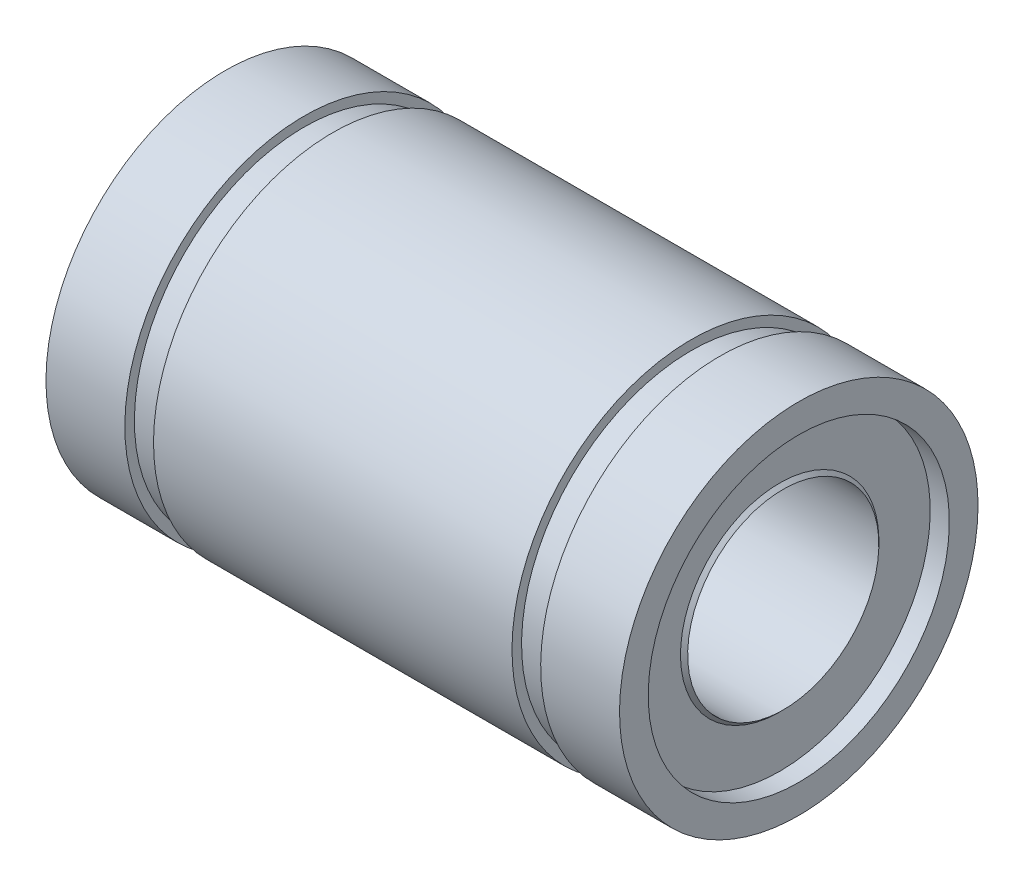
ISO-10303-21;
HEADER;
FILE_DESCRIPTION(('STEP AP214'),'2;1');
FILE_NAME('part.step','',(''),(''),'','','');
FILE_SCHEMA(('AUTOMOTIVE_DESIGN { 1 0 10303 214 1 1 1 1 }'));
ENDSEC;
DATA;
#1=APPLICATION_CONTEXT('core data for automotive mechanical design processes');
#2=APPLICATION_PROTOCOL_DEFINITION('international standard','automotive_design',2000,#1);
#3=PRODUCT_CONTEXT('',#1,'mechanical');
#4=PRODUCT('Part','Part','',(#3));
#5=PRODUCT_RELATED_PRODUCT_CATEGORY('part','',(#4));
#6=PRODUCT_DEFINITION_FORMATION('','',#4);
#7=PRODUCT_DEFINITION_CONTEXT('part definition',#1,'design');
#8=PRODUCT_DEFINITION('design','',#6,#7);
#9=PRODUCT_DEFINITION_SHAPE('','',#8);
#10=(LENGTH_UNIT() NAMED_UNIT(*) SI_UNIT(.MILLI.,.METRE.));
#11=(NAMED_UNIT(*) PLANE_ANGLE_UNIT() SI_UNIT($,.RADIAN.));
#12=(NAMED_UNIT(*) SI_UNIT($,.STERADIAN.) SOLID_ANGLE_UNIT());
#13=UNCERTAINTY_MEASURE_WITH_UNIT(LENGTH_MEASURE(1.E-05),#10,'distance_accuracy_value','');
#14=(GEOMETRIC_REPRESENTATION_CONTEXT(3) GLOBAL_UNCERTAINTY_ASSIGNED_CONTEXT((#13)) GLOBAL_UNIT_ASSIGNED_CONTEXT((#10,
#11,#12)) REPRESENTATION_CONTEXT('',''));
#15=CARTESIAN_POINT('',(0.,0.,0.));
#16=DIRECTION('',(0.,0.,1.));
#17=DIRECTION('',(1.,0.,0.));
#18=AXIS2_PLACEMENT_3D('',#15,#16,#17);
#19=CARTESIAN_POINT('',(-16.830555472771,-10.245239863841,5.674899117618));
#20=DIRECTION('',(1.,0.,0.));
#21=DIRECTION('',(0.,-0.982567445911182,-0.185906466362998));
#22=AXIS2_PLACEMENT_3D('',#19,#20,#21);
#23=CONICAL_SURFACE('',#22,4.075,0.785398163397448);
#24=CARTESIAN_POINT('',(-16.755555472771,-10.245239863841,5.674899117618));
#25=DIRECTION('',(1.,0.,0.));
#26=DIRECTION('',(0.,-0.185906466362998,0.982567445911182));
#27=AXIS2_PLACEMENT_3D('',#24,#25,#26);
#28=CIRCLE('',#27,4.15);
#29=CARTESIAN_POINT('',(-16.755555472771,-14.3228947643724,4.90338728221156));
#30=VERTEX_POINT('',#29);
#31=CARTESIAN_POINT('',(-16.755555472771,-6.16758496330959,6.44641095302444));
#32=VERTEX_POINT('',#31);
#33=EDGE_CURVE('E41',#30,#32,#28,.T.);
#34=ORIENTED_EDGE('',*,*,#33,.F.);
#35=CARTESIAN_POINT('',(-16.755555472771,-10.245239863841,5.674899117618));
#36=DIRECTION('',(1.,0.,0.));
#37=DIRECTION('',(0.,-0.185906466362998,0.982567445911182));
#38=AXIS2_PLACEMENT_3D('',#35,#36,#37);
#39=CIRCLE('',#38,4.15);
#40=EDGE_CURVE('E207',#32,#30,#39,.T.);
#41=ORIENTED_EDGE('',*,*,#40,.F.);
#42=DIRECTION('',(-0.707106781186547,-0.694780103976944,-0.131455723031705));
#43=VECTOR('',#42,1.);
#44=CARTESIAN_POINT('',(-16.830555472771,-6.24127752175293,6.43246796804722));
#45=LINE('',#44,#43);
#46=CARTESIAN_POINT('',(-16.905555472771,-6.31497008019627,6.41852498306999));
#47=VERTEX_POINT('',#46);
#48=EDGE_CURVE('E11',#32,#47,#45,.T.);
#49=ORIENTED_EDGE('',*,*,#48,.T.);
#50=CARTESIAN_POINT('',(-16.905555472771,-10.245239863841,5.674899117618));
#51=DIRECTION('',(1.,0.,0.));
#52=DIRECTION('',(0.,-0.185906466362998,0.982567445911182));
#53=AXIS2_PLACEMENT_3D('',#50,#51,#52);
#54=CIRCLE('',#53,4.);
#55=CARTESIAN_POINT('',(-16.905555472771,-14.1755096474857,4.93127325216601));
#56=VERTEX_POINT('',#55);
#57=EDGE_CURVE('E27',#47,#56,#54,.T.);
#58=ORIENTED_EDGE('',*,*,#57,.T.);
#59=CARTESIAN_POINT('',(-16.905555472771,-10.245239863841,5.674899117618));
#60=DIRECTION('',(1.,0.,0.));
#61=DIRECTION('',(0.,-0.185906466362998,0.982567445911182));
#62=AXIS2_PLACEMENT_3D('',#59,#60,#61);
#63=CIRCLE('',#62,4.);
#64=EDGE_CURVE('E206',#56,#47,#63,.T.);
#65=ORIENTED_EDGE('',*,*,#64,.T.);
#66=ORIENTED_EDGE('',*,*,#48,.F.);
#67=EDGE_LOOP('',(#34,#41,#49,#58,#65,#66));
#68=FACE_BOUND('',#67,.T.);
#69=ADVANCED_FACE('F16',(#68),#23,.T.);
#70=CARTESIAN_POINT('',(-16.755555472771,-16.4354147730814,4.50368837953111));
#71=DIRECTION('',(-1.,0.,0.));
#72=DIRECTION('',(0.,0.185906466362998,-0.982567445911182));
#73=AXIS2_PLACEMENT_3D('',#70,#71,#72);
#74=PLANE('',#73);
#75=CARTESIAN_POINT('',(-16.755555472771,-10.245239863841,5.674899117618));
#76=DIRECTION('',(1.,0.,0.));
#77=DIRECTION('',(0.,-0.185906466362998,0.982567445911182));
#78=AXIS2_PLACEMENT_3D('',#75,#76,#77);
#79=CIRCLE('',#78,6.3);
#80=CARTESIAN_POINT('',(-16.755555472771,-16.4354147730814,4.50368837953111));
#81=VERTEX_POINT('',#80);
#82=CARTESIAN_POINT('',(-16.755555472771,-4.05506495460056,6.84610985570489));
#83=VERTEX_POINT('',#82);
#84=EDGE_CURVE('E289',#81,#83,#79,.T.);
#85=ORIENTED_EDGE('',*,*,#84,.F.);
#86=CARTESIAN_POINT('',(-16.755555472771,-10.245239863841,5.674899117618));
#87=DIRECTION('',(1.,0.,0.));
#88=DIRECTION('',(0.,-0.185906466362998,0.982567445911182));
#89=AXIS2_PLACEMENT_3D('',#86,#87,#88);
#90=CIRCLE('',#89,6.3);
#91=EDGE_CURVE('E239',#83,#81,#90,.T.);
#92=ORIENTED_EDGE('',*,*,#91,.F.);
#93=EDGE_LOOP('',(#85,#92));
#94=FACE_BOUND('',#93,.T.);
#95=ORIENTED_EDGE('',*,*,#33,.T.);
#96=ORIENTED_EDGE('',*,*,#40,.T.);
#97=EDGE_LOOP('',(#95,#96));
#98=FACE_BOUND('',#97,.T.);
#99=ADVANCED_FACE('F370',(#94,#98),#74,.T.);
#100=CARTESIAN_POINT('',(-17.155555472771,-10.245239863841,5.674899117618));
#101=DIRECTION('',(1.,0.,0.));
#102=DIRECTION('',(0.,-0.982567445911182,-0.185906466362998));
#103=AXIS2_PLACEMENT_3D('',#100,#101,#102);
#104=CYLINDRICAL_SURFACE('',#103,6.3);
#105=ORIENTED_EDGE('',*,*,#84,.T.);
#106=DIRECTION('',(-1.,0.,0.));
#107=VECTOR('',#106,1.);
#108=CARTESIAN_POINT('',(-17.155555472771,-4.05506495460056,6.84610985570489));
#109=LINE('',#108,#107);
#110=CARTESIAN_POINT('',(-17.555555472771,-4.05506495460056,6.84610985570489));
#111=VERTEX_POINT('',#110);
#112=EDGE_CURVE('E243',#83,#111,#109,.T.);
#113=ORIENTED_EDGE('',*,*,#112,.T.);
#114=CARTESIAN_POINT('',(-17.555555472771,-10.245239863841,5.674899117618));
#115=DIRECTION('',(1.,0.,0.));
#116=DIRECTION('',(0.,-0.185906466362998,0.982567445911182));
#117=AXIS2_PLACEMENT_3D('',#114,#115,#116);
#118=CIRCLE('',#117,6.3);
#119=CARTESIAN_POINT('',(-17.555555472771,-16.4354147730814,4.50368837953111));
#120=VERTEX_POINT('',#119);
#121=EDGE_CURVE('E199',#120,#111,#118,.T.);
#122=ORIENTED_EDGE('',*,*,#121,.F.);
#123=CARTESIAN_POINT('',(-17.555555472771,-10.245239863841,5.674899117618));
#124=DIRECTION('',(1.,0.,0.));
#125=DIRECTION('',(0.,-0.185906466362998,0.982567445911182));
#126=AXIS2_PLACEMENT_3D('',#123,#124,#125);
#127=CIRCLE('',#126,6.3);
#128=EDGE_CURVE('E192',#111,#120,#127,.T.);
#129=ORIENTED_EDGE('',*,*,#128,.F.);
#130=ORIENTED_EDGE('',*,*,#112,.F.);
#131=ORIENTED_EDGE('',*,*,#91,.T.);
#132=EDGE_LOOP('',(#105,#113,#122,#129,#130,#131));
#133=FACE_BOUND('',#132,.T.);
#134=ADVANCED_FACE('F375',(#133),#104,.F.);
#135=CARTESIAN_POINT('',(-17.555555472771,-17.6144957081749,4.28060061989552));
#136=DIRECTION('',(-1.,0.,0.));
#137=DIRECTION('',(0.,0.185906466362998,-0.982567445911182));
#138=AXIS2_PLACEMENT_3D('',#135,#136,#137);
#139=PLANE('',#138);
#140=CARTESIAN_POINT('',(-17.555555472771,-10.245239863841,5.674899117618));
#141=DIRECTION('',(1.,0.,0.));
#142=DIRECTION('',(0.,-0.185906466362998,0.982567445911182));
#143=AXIS2_PLACEMENT_3D('',#140,#141,#142);
#144=CIRCLE('',#143,7.5);
#145=CARTESIAN_POINT('',(-17.555555472771,-17.6144957081749,4.28060061989552));
#146=VERTEX_POINT('',#145);
#147=CARTESIAN_POINT('',(-17.555555472771,-2.87598401950713,7.06919761534049));
#148=VERTEX_POINT('',#147);
#149=EDGE_CURVE('E20',#146,#148,#144,.T.);
#150=ORIENTED_EDGE('',*,*,#149,.F.);
#151=CARTESIAN_POINT('',(-17.555555472771,-10.245239863841,5.674899117618));
#152=DIRECTION('',(1.,0.,0.));
#153=DIRECTION('',(0.,-0.185906466362998,0.982567445911182));
#154=AXIS2_PLACEMENT_3D('',#151,#152,#153);
#155=CIRCLE('',#154,7.5);
#156=EDGE_CURVE('E180',#148,#146,#155,.T.);
#157=ORIENTED_EDGE('',*,*,#156,.F.);
#158=EDGE_LOOP('',(#150,#157));
#159=FACE_BOUND('',#158,.T.);
#160=ORIENTED_EDGE('',*,*,#121,.T.);
#161=ORIENTED_EDGE('',*,*,#128,.T.);
#162=EDGE_LOOP('',(#160,#161));
#163=FACE_BOUND('',#162,.T.);
#164=ADVANCED_FACE('F184',(#159,#163),#139,.T.);
#165=CARTESIAN_POINT('',(-15.905555472771,-10.245239863841,5.674899117618));
#166=DIRECTION('',(1.,0.,0.));
#167=DIRECTION('',(0.,-0.982567445911182,-0.185906466362998));
#168=AXIS2_PLACEMENT_3D('',#165,#166,#167);
#169=CYLINDRICAL_SURFACE('',#168,7.5);
#170=CARTESIAN_POINT('',(-14.255555472771,-10.245239863841,5.674899117618));
#171=DIRECTION('',(1.,0.,0.));
#172=DIRECTION('',(0.,-0.185906466362998,0.982567445911182));
#173=AXIS2_PLACEMENT_3D('',#170,#171,#172);
#174=CIRCLE('',#173,7.5);
#175=CARTESIAN_POINT('',(-14.255555472771,-17.6144957081749,4.28060061989552));
#176=VERTEX_POINT('',#175);
#177=CARTESIAN_POINT('',(-14.255555472771,-2.87598401950713,7.06919761534049));
#178=VERTEX_POINT('',#177);
#179=EDGE_CURVE('E183',#176,#178,#174,.T.);
#180=ORIENTED_EDGE('',*,*,#179,.F.);
#181=CARTESIAN_POINT('',(-14.255555472771,-10.245239863841,5.674899117618));
#182=DIRECTION('',(1.,0.,0.));
#183=DIRECTION('',(0.,-0.185906466362998,0.982567445911182));
#184=AXIS2_PLACEMENT_3D('',#181,#182,#183);
#185=CIRCLE('',#184,7.5);
#186=EDGE_CURVE('E189',#178,#176,#185,.T.);
#187=ORIENTED_EDGE('',*,*,#186,.F.);
#188=DIRECTION('',(-1.,0.,0.));
#189=VECTOR('',#188,1.);
#190=CARTESIAN_POINT('',(-15.905555472771,-2.87598401950713,7.06919761534049));
#191=LINE('',#190,#189);
#192=EDGE_CURVE('E179',#178,#148,#191,.T.);
#193=ORIENTED_EDGE('',*,*,#192,.T.);
#194=ORIENTED_EDGE('',*,*,#156,.T.);
#195=ORIENTED_EDGE('',*,*,#149,.T.);
#196=ORIENTED_EDGE('',*,*,#192,.F.);
#197=EDGE_LOOP('',(#180,#187,#193,#194,#195,#196));
#198=FACE_BOUND('',#197,.T.);
#199=ADVANCED_FACE('F177',(#198),#169,.T.);
#200=CARTESIAN_POINT('',(-14.255555472771,-17.2214687298104,4.35496320644071));
#201=DIRECTION('',(1.,0.,0.));
#202=DIRECTION('',(0.,-0.982567445911182,-0.185906466362998));
#203=AXIS2_PLACEMENT_3D('',#200,#201,#202);
#204=PLANE('',#203);
#205=ORIENTED_EDGE('',*,*,#179,.T.);
#206=ORIENTED_EDGE('',*,*,#186,.T.);
#207=EDGE_LOOP('',(#205,#206));
#208=FACE_BOUND('',#207,.T.);
#209=CARTESIAN_POINT('',(-14.255555472771,-10.245239863841,5.674899117618));
#210=DIRECTION('',(1.,0.,0.));
#211=DIRECTION('',(0.,-0.185906466362998,0.982567445911182));
#212=AXIS2_PLACEMENT_3D('',#209,#210,#211);
#213=CIRCLE('',#212,7.1);
#214=CARTESIAN_POINT('',(-14.255555472771,-17.2214687298104,4.35496320644071));
#215=VERTEX_POINT('',#214);
#216=CARTESIAN_POINT('',(-14.255555472771,-3.26901099787161,6.99483502879529));
#217=VERTEX_POINT('',#216);
#218=EDGE_CURVE('E230',#215,#217,#213,.T.);
#219=ORIENTED_EDGE('',*,*,#218,.F.);
#220=CARTESIAN_POINT('',(-14.255555472771,-10.245239863841,5.674899117618));
#221=DIRECTION('',(1.,0.,0.));
#222=DIRECTION('',(0.,-0.185906466362998,0.982567445911182));
#223=AXIS2_PLACEMENT_3D('',#220,#221,#222);
#224=CIRCLE('',#223,7.1);
#225=EDGE_CURVE('E232',#217,#215,#224,.T.);
#226=ORIENTED_EDGE('',*,*,#225,.F.);
#227=EDGE_LOOP('',(#219,#226));
#228=FACE_BOUND('',#227,.T.);
#229=ADVANCED_FACE('F354',(#208,#228),#204,.T.);
#230=CARTESIAN_POINT('',(-13.655555472771,-10.245239863841,5.674899117618));
#231=DIRECTION('',(1.,0.,0.));
#232=DIRECTION('',(0.,-0.982567445911182,-0.185906466362998));
#233=AXIS2_PLACEMENT_3D('',#230,#231,#232);
#234=CYLINDRICAL_SURFACE('',#233,7.1);
#235=CARTESIAN_POINT('',(-13.055555472771,-10.245239863841,5.674899117618));
#236=DIRECTION('',(1.,0.,0.));
#237=DIRECTION('',(0.,-0.185906466362998,0.982567445911182));
#238=AXIS2_PLACEMENT_3D('',#235,#236,#237);
#239=CIRCLE('',#238,7.1);
#240=CARTESIAN_POINT('',(-13.055555472771,-17.2214687298104,4.35496320644071));
#241=VERTEX_POINT('',#240);
#242=CARTESIAN_POINT('',(-13.055555472771,-3.26901099787161,6.99483502879529));
#243=VERTEX_POINT('',#242);
#244=EDGE_CURVE('E233',#241,#243,#239,.T.);
#245=ORIENTED_EDGE('',*,*,#244,.F.);
#246=CARTESIAN_POINT('',(-13.055555472771,-10.245239863841,5.674899117618));
#247=DIRECTION('',(1.,0.,0.));
#248=DIRECTION('',(0.,-0.185906466362998,0.982567445911182));
#249=AXIS2_PLACEMENT_3D('',#246,#247,#248);
#250=CIRCLE('',#249,7.1);
#251=EDGE_CURVE('E286',#243,#241,#250,.T.);
#252=ORIENTED_EDGE('',*,*,#251,.F.);
#253=DIRECTION('',(-1.,0.,0.));
#254=VECTOR('',#253,1.);
#255=CARTESIAN_POINT('',(-13.655555472771,-3.26901099787161,6.99483502879529));
#256=LINE('',#255,#254);
#257=EDGE_CURVE('E280',#243,#217,#256,.T.);
#258=ORIENTED_EDGE('',*,*,#257,.T.);
#259=ORIENTED_EDGE('',*,*,#225,.T.);
#260=ORIENTED_EDGE('',*,*,#218,.T.);
#261=ORIENTED_EDGE('',*,*,#257,.F.);
#262=EDGE_LOOP('',(#245,#252,#258,#259,#260,#261));
#263=FACE_BOUND('',#262,.T.);
#264=ADVANCED_FACE('F346',(#263),#234,.T.);
#265=CARTESIAN_POINT('',(-13.055555472771,-17.6144957081749,4.28060061989552));
#266=DIRECTION('',(-1.,0.,0.));
#267=DIRECTION('',(0.,0.185906466362998,-0.982567445911182));
#268=AXIS2_PLACEMENT_3D('',#265,#266,#267);
#269=PLANE('',#268);
#270=CARTESIAN_POINT('',(-13.055555472771,-10.245239863841,5.674899117618));
#271=DIRECTION('',(1.,0.,0.));
#272=DIRECTION('',(0.,-0.185906466362998,0.982567445911182));
#273=AXIS2_PLACEMENT_3D('',#270,#271,#272);
#274=CIRCLE('',#273,7.5);
#275=CARTESIAN_POINT('',(-13.055555472771,-17.6144957081749,4.28060061989552));
#276=VERTEX_POINT('',#275);
#277=CARTESIAN_POINT('',(-13.055555472771,-2.87598401950713,7.06919761534049));
#278=VERTEX_POINT('',#277);
#279=EDGE_CURVE('E272',#276,#278,#274,.T.);
#280=ORIENTED_EDGE('',*,*,#279,.F.);
#281=CARTESIAN_POINT('',(-13.055555472771,-10.245239863841,5.674899117618));
#282=DIRECTION('',(1.,0.,0.));
#283=DIRECTION('',(0.,-0.185906466362998,0.982567445911182));
#284=AXIS2_PLACEMENT_3D('',#281,#282,#283);
#285=CIRCLE('',#284,7.5);
#286=EDGE_CURVE('E275',#278,#276,#285,.T.);
#287=ORIENTED_EDGE('',*,*,#286,.F.);
#288=EDGE_LOOP('',(#280,#287));
#289=FACE_BOUND('',#288,.T.);
#290=ORIENTED_EDGE('',*,*,#244,.T.);
#291=ORIENTED_EDGE('',*,*,#251,.T.);
#292=EDGE_LOOP('',(#290,#291));
#293=FACE_BOUND('',#292,.T.);
#294=ADVANCED_FACE('F343',(#289,#293),#269,.T.);
#295=CARTESIAN_POINT('',(-5.555555472771,-10.245239863841,5.674899117618));
#296=DIRECTION('',(1.,0.,0.));
#297=DIRECTION('',(0.,-0.982567445911182,-0.185906466362998));
#298=AXIS2_PLACEMENT_3D('',#295,#296,#297);
#299=CYLINDRICAL_SURFACE('',#298,7.5);
#300=CARTESIAN_POINT('',(1.944444527229,-10.245239863841,5.674899117618));
#301=DIRECTION('',(1.,0.,0.));
#302=DIRECTION('',(0.,-0.185906466362998,0.982567445911182));
#303=AXIS2_PLACEMENT_3D('',#300,#301,#302);
#304=CIRCLE('',#303,7.5);
#305=CARTESIAN_POINT('',(1.944444527229,-17.6144957081749,4.28060061989552));
#306=VERTEX_POINT('',#305);
#307=CARTESIAN_POINT('',(1.944444527229,-2.87598401950711,7.06919761534049));
#308=VERTEX_POINT('',#307);
#309=EDGE_CURVE('E276',#306,#308,#304,.T.);
#310=ORIENTED_EDGE('',*,*,#309,.F.);
#311=CARTESIAN_POINT('',(1.944444527229,-10.245239863841,5.674899117618));
#312=DIRECTION('',(1.,0.,0.));
#313=DIRECTION('',(0.,-0.185906466362998,0.982567445911182));
#314=AXIS2_PLACEMENT_3D('',#311,#312,#313);
#315=CIRCLE('',#314,7.5);
#316=EDGE_CURVE('E298',#308,#306,#315,.T.);
#317=ORIENTED_EDGE('',*,*,#316,.F.);
#318=DIRECTION('',(-1.,0.,0.));
#319=VECTOR('',#318,1.);
#320=CARTESIAN_POINT('',(-5.55555547277101,-2.87598401950713,7.06919761534049));
#321=LINE('',#320,#319);
#322=EDGE_CURVE('E313',#308,#278,#321,.T.);
#323=ORIENTED_EDGE('',*,*,#322,.T.);
#324=ORIENTED_EDGE('',*,*,#286,.T.);
#325=ORIENTED_EDGE('',*,*,#279,.T.);
#326=ORIENTED_EDGE('',*,*,#322,.F.);
#327=EDGE_LOOP('',(#310,#317,#323,#324,#325,#326));
#328=FACE_BOUND('',#327,.T.);
#329=ADVANCED_FACE('F340',(#328),#299,.T.);
#330=CARTESIAN_POINT('',(1.944444527229,-17.2214687298104,4.35496320644071));
#331=DIRECTION('',(1.,0.,0.));
#332=DIRECTION('',(0.,-0.982567445911182,-0.185906466362998));
#333=AXIS2_PLACEMENT_3D('',#330,#331,#332);
#334=PLANE('',#333);
#335=ORIENTED_EDGE('',*,*,#309,.T.);
#336=ORIENTED_EDGE('',*,*,#316,.T.);
#337=EDGE_LOOP('',(#335,#336));
#338=FACE_BOUND('',#337,.T.);
#339=CARTESIAN_POINT('',(1.944444527229,-10.245239863841,5.674899117618));
#340=DIRECTION('',(1.,0.,0.));
#341=DIRECTION('',(0.,-0.185906466362998,0.982567445911182));
#342=AXIS2_PLACEMENT_3D('',#339,#340,#341);
#343=CIRCLE('',#342,7.1);
#344=CARTESIAN_POINT('',(1.944444527229,-17.2214687298104,4.35496320644071));
#345=VERTEX_POINT('',#344);
#346=CARTESIAN_POINT('',(1.944444527229,-3.26901099787159,6.99483502879529));
#347=VERTEX_POINT('',#346);
#348=EDGE_CURVE('E227',#345,#347,#343,.T.);
#349=ORIENTED_EDGE('',*,*,#348,.F.);
#350=CARTESIAN_POINT('',(1.944444527229,-10.245239863841,5.674899117618));
#351=DIRECTION('',(1.,0.,0.));
#352=DIRECTION('',(0.,-0.185906466362998,0.982567445911182));
#353=AXIS2_PLACEMENT_3D('',#350,#351,#352);
#354=CIRCLE('',#353,7.1);
#355=EDGE_CURVE('E222',#347,#345,#354,.T.);
#356=ORIENTED_EDGE('',*,*,#355,.F.);
#357=EDGE_LOOP('',(#349,#356));
#358=FACE_BOUND('',#357,.T.);
#359=ADVANCED_FACE('F387',(#338,#358),#334,.T.);
#360=CARTESIAN_POINT('',(2.544444527229,-10.245239863841,5.674899117618));
#361=DIRECTION('',(1.,0.,0.));
#362=DIRECTION('',(0.,-0.982567445911182,-0.185906466362998));
#363=AXIS2_PLACEMENT_3D('',#360,#361,#362);
#364=CYLINDRICAL_SURFACE('',#363,7.1);
#365=CARTESIAN_POINT('',(3.144444527229,-10.245239863841,5.674899117618));
#366=DIRECTION('',(1.,0.,0.));
#367=DIRECTION('',(0.,-0.185906466362998,0.982567445911182));
#368=AXIS2_PLACEMENT_3D('',#365,#366,#367);
#369=CIRCLE('',#368,7.1);
#370=CARTESIAN_POINT('',(3.144444527229,-17.2214687298104,4.35496320644071));
#371=VERTEX_POINT('',#370);
#372=CARTESIAN_POINT('',(3.144444527229,-3.26901099787159,6.99483502879529));
#373=VERTEX_POINT('',#372);
#374=EDGE_CURVE('E235',#371,#373,#369,.T.);
#375=ORIENTED_EDGE('',*,*,#374,.F.);
#376=CARTESIAN_POINT('',(3.144444527229,-10.245239863841,5.674899117618));
#377=DIRECTION('',(1.,0.,0.));
#378=DIRECTION('',(0.,-0.185906466362998,0.982567445911182));
#379=AXIS2_PLACEMENT_3D('',#376,#377,#378);
#380=CIRCLE('',#379,7.1);
#381=EDGE_CURVE('E214',#373,#371,#380,.T.);
#382=ORIENTED_EDGE('',*,*,#381,.F.);
#383=DIRECTION('',(-1.,0.,0.));
#384=VECTOR('',#383,1.);
#385=CARTESIAN_POINT('',(2.544444527229,-3.26901099787159,6.99483502879529));
#386=LINE('',#385,#384);
#387=EDGE_CURVE('E226',#373,#347,#386,.T.);
#388=ORIENTED_EDGE('',*,*,#387,.T.);
#389=ORIENTED_EDGE('',*,*,#355,.T.);
#390=ORIENTED_EDGE('',*,*,#348,.T.);
#391=ORIENTED_EDGE('',*,*,#387,.F.);
#392=EDGE_LOOP('',(#375,#382,#388,#389,#390,#391));
#393=FACE_BOUND('',#392,.T.);
#394=ADVANCED_FACE('F391',(#393),#364,.T.);
#395=CARTESIAN_POINT('',(3.144444527229,-17.6144957081749,4.28060061989552));
#396=DIRECTION('',(-1.,0.,0.));
#397=DIRECTION('',(0.,0.185906466362998,-0.982567445911182));
#398=AXIS2_PLACEMENT_3D('',#395,#396,#397);
#399=PLANE('',#398);
#400=CARTESIAN_POINT('',(3.144444527229,-10.245239863841,5.674899117618));
#401=DIRECTION('',(1.,0.,0.));
#402=DIRECTION('',(0.,-0.185906466362998,0.982567445911182));
#403=AXIS2_PLACEMENT_3D('',#400,#401,#402);
#404=CIRCLE('',#403,7.5);
#405=CARTESIAN_POINT('',(3.144444527229,-17.6144957081749,4.28060061989552));
#406=VERTEX_POINT('',#405);
#407=CARTESIAN_POINT('',(3.144444527229,-2.87598401950711,7.06919761534049));
#408=VERTEX_POINT('',#407);
#409=EDGE_CURVE('E270',#406,#408,#404,.T.);
#410=ORIENTED_EDGE('',*,*,#409,.F.);
#411=CARTESIAN_POINT('',(3.144444527229,-10.245239863841,5.674899117618));
#412=DIRECTION('',(1.,0.,0.));
#413=DIRECTION('',(0.,-0.185906466362998,0.982567445911182));
#414=AXIS2_PLACEMENT_3D('',#411,#412,#413);
#415=CIRCLE('',#414,7.5);
#416=EDGE_CURVE('E215',#408,#406,#415,.T.);
#417=ORIENTED_EDGE('',*,*,#416,.F.);
#418=EDGE_LOOP('',(#410,#417));
#419=FACE_BOUND('',#418,.T.);
#420=ORIENTED_EDGE('',*,*,#374,.T.);
#421=ORIENTED_EDGE('',*,*,#381,.T.);
#422=EDGE_LOOP('',(#420,#421));
#423=FACE_BOUND('',#422,.T.);
#424=ADVANCED_FACE('F393',(#419,#423),#399,.T.);
#425=CARTESIAN_POINT('',(4.794444527229,-10.245239863841,5.674899117618));
#426=DIRECTION('',(1.,0.,0.));
#427=DIRECTION('',(0.,-0.982567445911182,-0.185906466362998));
#428=AXIS2_PLACEMENT_3D('',#425,#426,#427);
#429=CYLINDRICAL_SURFACE('',#428,7.5);
#430=CARTESIAN_POINT('',(6.444444527229,-10.245239863841,5.674899117618));
#431=DIRECTION('',(1.,0.,0.));
#432=DIRECTION('',(0.,-0.185906466362998,0.982567445911182));
#433=AXIS2_PLACEMENT_3D('',#430,#431,#432);
#434=CIRCLE('',#433,7.5);
#435=CARTESIAN_POINT('',(6.44444452722901,-17.6144957081749,4.28060061989552));
#436=VERTEX_POINT('',#435);
#437=CARTESIAN_POINT('',(6.44444452722899,-2.87598401950711,7.06919761534049));
#438=VERTEX_POINT('',#437);
#439=EDGE_CURVE('E266',#436,#438,#434,.T.);
#440=ORIENTED_EDGE('',*,*,#439,.F.);
#441=CARTESIAN_POINT('',(6.444444527229,-10.245239863841,5.674899117618));
#442=DIRECTION('',(1.,0.,0.));
#443=DIRECTION('',(0.,-0.185906466362998,0.982567445911182));
#444=AXIS2_PLACEMENT_3D('',#441,#442,#443);
#445=CIRCLE('',#444,7.5);
#446=EDGE_CURVE('E271',#438,#436,#445,.T.);
#447=ORIENTED_EDGE('',*,*,#446,.F.);
#448=DIRECTION('',(-1.,0.,0.));
#449=VECTOR('',#448,1.);
#450=CARTESIAN_POINT('',(4.79444452722899,-2.87598401950711,7.06919761534049));
#451=LINE('',#450,#449);
#452=EDGE_CURVE('E210',#438,#408,#451,.T.);
#453=ORIENTED_EDGE('',*,*,#452,.T.);
#454=ORIENTED_EDGE('',*,*,#416,.T.);
#455=ORIENTED_EDGE('',*,*,#409,.T.);
#456=ORIENTED_EDGE('',*,*,#452,.F.);
#457=EDGE_LOOP('',(#440,#447,#453,#454,#455,#456));
#458=FACE_BOUND('',#457,.T.);
#459=ADVANCED_FACE('F405',(#458),#429,.T.);
#460=CARTESIAN_POINT('',(6.44444452722901,-16.4354147730814,4.50368837953111));
#461=DIRECTION('',(1.,0.,0.));
#462=DIRECTION('',(0.,-0.982567445911182,-0.185906466362998));
#463=AXIS2_PLACEMENT_3D('',#460,#461,#462);
#464=PLANE('',#463);
#465=ORIENTED_EDGE('',*,*,#439,.T.);
#466=ORIENTED_EDGE('',*,*,#446,.T.);
#467=EDGE_LOOP('',(#465,#466));
#468=FACE_BOUND('',#467,.T.);
#469=CARTESIAN_POINT('',(6.444444527229,-10.245239863841,5.674899117618));
#470=DIRECTION('',(1.,0.,0.));
#471=DIRECTION('',(0.,-0.185906466362998,0.982567445911182));
#472=AXIS2_PLACEMENT_3D('',#469,#470,#471);
#473=CIRCLE('',#472,6.3);
#474=CARTESIAN_POINT('',(6.44444452722901,-16.4354147730814,4.50368837953111));
#475=VERTEX_POINT('',#474);
#476=CARTESIAN_POINT('',(6.44444452722899,-4.05506495460053,6.84610985570489));
#477=VERTEX_POINT('',#476);
#478=EDGE_CURVE('E303',#475,#477,#473,.T.);
#479=ORIENTED_EDGE('',*,*,#478,.F.);
#480=CARTESIAN_POINT('',(6.444444527229,-10.245239863841,5.674899117618));
#481=DIRECTION('',(1.,0.,0.));
#482=DIRECTION('',(0.,-0.185906466362998,0.982567445911182));
#483=AXIS2_PLACEMENT_3D('',#480,#481,#482);
#484=CIRCLE('',#483,6.3);
#485=EDGE_CURVE('E304',#477,#475,#484,.T.);
#486=ORIENTED_EDGE('',*,*,#485,.F.);
#487=EDGE_LOOP('',(#479,#486));
#488=FACE_BOUND('',#487,.T.);
#489=ADVANCED_FACE('F412',(#468,#488),#464,.T.);
#490=CARTESIAN_POINT('',(6.044444527229,-10.245239863841,5.674899117618));
#491=DIRECTION('',(1.,0.,0.));
#492=DIRECTION('',(0.,-0.982567445911182,-0.185906466362998));
#493=AXIS2_PLACEMENT_3D('',#490,#491,#492);
#494=CYLINDRICAL_SURFACE('',#493,6.3);
#495=ORIENTED_EDGE('',*,*,#478,.T.);
#496=DIRECTION('',(-1.,0.,0.));
#497=VECTOR('',#496,1.);
#498=CARTESIAN_POINT('',(6.04444452722899,-4.05506495460053,6.84610985570489));
#499=LINE('',#498,#497);
#500=CARTESIAN_POINT('',(5.64444452722899,-4.05506495460053,6.84610985570489));
#501=VERTEX_POINT('',#500);
#502=EDGE_CURVE('E299',#477,#501,#499,.T.);
#503=ORIENTED_EDGE('',*,*,#502,.T.);
#504=CARTESIAN_POINT('',(5.644444527229,-10.245239863841,5.674899117618));
#505=DIRECTION('',(1.,0.,0.));
#506=DIRECTION('',(0.,-0.185906466362998,0.982567445911182));
#507=AXIS2_PLACEMENT_3D('',#504,#505,#506);
#508=CIRCLE('',#507,6.3);
#509=CARTESIAN_POINT('',(5.64444452722901,-16.4354147730814,4.50368837953111));
#510=VERTEX_POINT('',#509);
#511=EDGE_CURVE('E247',#510,#501,#508,.T.);
#512=ORIENTED_EDGE('',*,*,#511,.F.);
#513=CARTESIAN_POINT('',(5.644444527229,-10.245239863841,5.674899117618));
#514=DIRECTION('',(1.,0.,0.));
#515=DIRECTION('',(0.,-0.185906466362998,0.982567445911182));
#516=AXIS2_PLACEMENT_3D('',#513,#514,#515);
#517=CIRCLE('',#516,6.3);
#518=EDGE_CURVE('E220',#501,#510,#517,.T.);
#519=ORIENTED_EDGE('',*,*,#518,.F.);
#520=ORIENTED_EDGE('',*,*,#502,.F.);
#521=ORIENTED_EDGE('',*,*,#485,.T.);
#522=EDGE_LOOP('',(#495,#503,#512,#519,#520,#521));
#523=FACE_BOUND('',#522,.T.);
#524=ADVANCED_FACE('F401',(#523),#494,.F.);
#525=CARTESIAN_POINT('',(5.644444527229,-14.3228947643724,4.90338728221156));
#526=DIRECTION('',(1.,0.,0.));
#527=DIRECTION('',(0.,-0.982567445911182,-0.185906466362998));
#528=AXIS2_PLACEMENT_3D('',#525,#526,#527);
#529=PLANE('',#528);
#530=ORIENTED_EDGE('',*,*,#511,.T.);
#531=ORIENTED_EDGE('',*,*,#518,.T.);
#532=EDGE_LOOP('',(#530,#531));
#533=FACE_BOUND('',#532,.T.);
#534=CARTESIAN_POINT('',(5.644444527229,-10.245239863841,5.674899117618));
#535=DIRECTION('',(1.,0.,0.));
#536=DIRECTION('',(0.,-0.185906466362998,0.982567445911182));
#537=AXIS2_PLACEMENT_3D('',#534,#535,#536);
#538=CIRCLE('',#537,4.15);
#539=CARTESIAN_POINT('',(5.644444527229,-14.3228947643724,4.90338728221156));
#540=VERTEX_POINT('',#539);
#541=CARTESIAN_POINT('',(5.644444527229,-6.16758496330957,6.44641095302444));
#542=VERTEX_POINT('',#541);
#543=EDGE_CURVE('E248',#540,#542,#538,.T.);
#544=ORIENTED_EDGE('',*,*,#543,.F.);
#545=CARTESIAN_POINT('',(5.644444527229,-10.245239863841,5.674899117618));
#546=DIRECTION('',(1.,0.,0.));
#547=DIRECTION('',(0.,-0.185906466362998,0.982567445911182));
#548=AXIS2_PLACEMENT_3D('',#545,#546,#547);
#549=CIRCLE('',#548,4.15);
#550=EDGE_CURVE('E221',#542,#540,#549,.T.);
#551=ORIENTED_EDGE('',*,*,#550,.F.);
#552=EDGE_LOOP('',(#544,#551));
#553=FACE_BOUND('',#552,.T.);
#554=ADVANCED_FACE('F399',(#533,#553),#529,.T.);
#555=CARTESIAN_POINT('',(5.719444527229,-10.245239863841,5.674899117618));
#556=DIRECTION('',(-1.,0.,0.));
#557=DIRECTION('',(0.,-0.982567445911182,-0.185906466362998));
#558=AXIS2_PLACEMENT_3D('',#555,#556,#557);
#559=CONICAL_SURFACE('',#558,4.075,0.785398163397448);
#560=CARTESIAN_POINT('',(5.794444527229,-10.245239863841,5.674899117618));
#561=DIRECTION('',(1.,0.,0.));
#562=DIRECTION('',(0.,-0.185906466362998,0.982567445911182));
#563=AXIS2_PLACEMENT_3D('',#560,#561,#562);
#564=CIRCLE('',#563,4.);
#565=CARTESIAN_POINT('',(5.794444527229,-14.1755096474857,4.93127325216601));
#566=VERTEX_POINT('',#565);
#567=CARTESIAN_POINT('',(5.794444527229,-6.31497008019625,6.41852498306999));
#568=VERTEX_POINT('',#567);
#569=EDGE_CURVE('E250',#566,#568,#564,.T.);
#570=ORIENTED_EDGE('',*,*,#569,.F.);
#571=CARTESIAN_POINT('',(5.794444527229,-10.245239863841,5.674899117618));
#572=DIRECTION('',(1.,0.,0.));
#573=DIRECTION('',(0.,-0.185906466362998,0.982567445911182));
#574=AXIS2_PLACEMENT_3D('',#571,#572,#573);
#575=CIRCLE('',#574,4.);
#576=EDGE_CURVE('E258',#568,#566,#575,.T.);
#577=ORIENTED_EDGE('',*,*,#576,.F.);
#578=DIRECTION('',(-0.707106781186549,0.694780103976943,0.131455723031705));
#579=VECTOR('',#578,1.);
#580=CARTESIAN_POINT('',(5.719444527229,-6.24127752175291,6.43246796804722));
#581=LINE('',#580,#579);
#582=EDGE_CURVE('E216',#568,#542,#581,.T.);
#583=ORIENTED_EDGE('',*,*,#582,.T.);
#584=ORIENTED_EDGE('',*,*,#550,.T.);
#585=ORIENTED_EDGE('',*,*,#543,.T.);
#586=ORIENTED_EDGE('',*,*,#582,.F.);
#587=EDGE_LOOP('',(#570,#577,#583,#584,#585,#586));
#588=FACE_BOUND('',#587,.T.);
#589=ADVANCED_FACE('F18',(#588),#559,.T.);
#590=CARTESIAN_POINT('',(-5.555555472771,-10.245239863841,5.674899117618));
#591=DIRECTION('',(1.,0.,0.));
#592=DIRECTION('',(0.,-0.982567445911182,-0.185906466362998));
#593=AXIS2_PLACEMENT_3D('',#590,#591,#592);
#594=CYLINDRICAL_SURFACE('',#593,4.);
#595=ORIENTED_EDGE('',*,*,#569,.T.);
#596=DIRECTION('',(-1.,0.,0.));
#597=VECTOR('',#596,1.);
#598=CARTESIAN_POINT('',(-5.555555472771,-6.31497008019626,6.41852498306999));
#599=LINE('',#598,#597);
#600=EDGE_CURVE('E262',#568,#47,#599,.T.);
#601=ORIENTED_EDGE('',*,*,#600,.T.);
#602=ORIENTED_EDGE('',*,*,#64,.F.);
#603=ORIENTED_EDGE('',*,*,#57,.F.);
#604=ORIENTED_EDGE('',*,*,#600,.F.);
#605=ORIENTED_EDGE('',*,*,#576,.T.);
#606=EDGE_LOOP('',(#595,#601,#602,#603,#604,#605));
#607=FACE_BOUND('',#606,.T.);
#608=ADVANCED_FACE('F382',(#607),#594,.F.);
#609=CLOSED_SHELL('',(#69,#99,#134,#164,#199,#229,#264,#294,#329,#359,#394,#424,#459,#489,#524,
#554,#589,#608));
#610=MANIFOLD_SOLID_BREP('B1',#609);
#611=ADVANCED_BREP_SHAPE_REPRESENTATION('',(#18,#610),#14);
#612=SHAPE_DEFINITION_REPRESENTATION(#9,#611);
ENDSEC;
END-ISO-10303-21;
